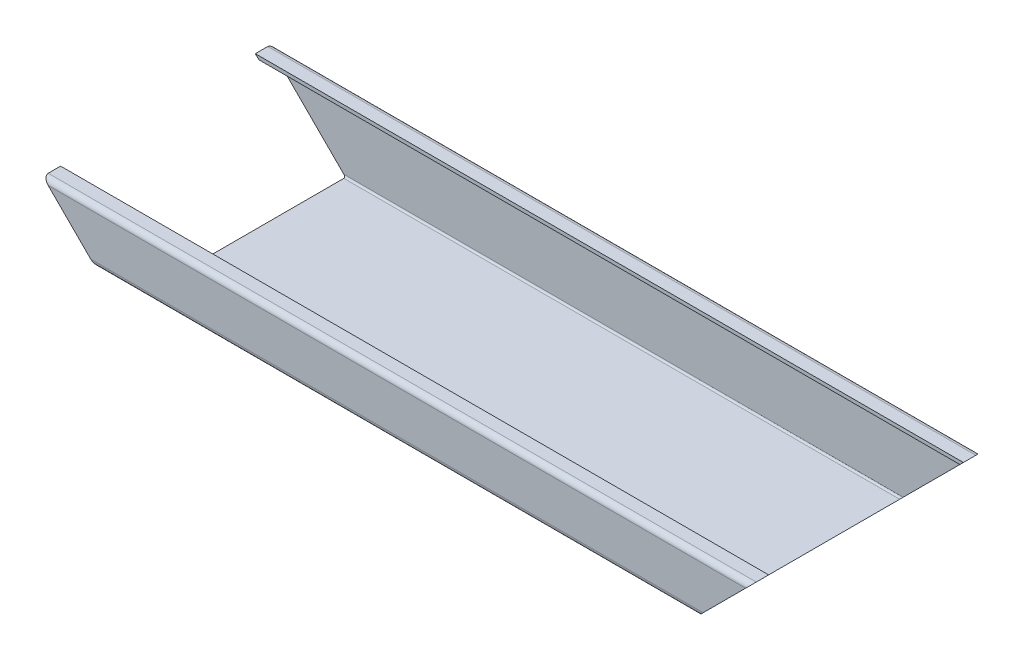
ISO-10303-21;
HEADER;
FILE_DESCRIPTION(('STEP AP214'),'2;1');
FILE_NAME('part.step','',(''),(''),'','','');
FILE_SCHEMA(('AUTOMOTIVE_DESIGN { 1 0 10303 214 1 1 1 1 }'));
ENDSEC;
DATA;
#1=APPLICATION_CONTEXT('core data for automotive mechanical design processes');
#2=APPLICATION_PROTOCOL_DEFINITION('international standard','automotive_design',2000,#1);
#3=PRODUCT_CONTEXT('',#1,'mechanical');
#4=PRODUCT('Part','Part','',(#3));
#5=PRODUCT_RELATED_PRODUCT_CATEGORY('part','',(#4));
#6=PRODUCT_DEFINITION_FORMATION('','',#4);
#7=PRODUCT_DEFINITION_CONTEXT('part definition',#1,'design');
#8=PRODUCT_DEFINITION('design','',#6,#7);
#9=PRODUCT_DEFINITION_SHAPE('','',#8);
#10=(LENGTH_UNIT() NAMED_UNIT(*) SI_UNIT(.MILLI.,.METRE.));
#11=(NAMED_UNIT(*) PLANE_ANGLE_UNIT() SI_UNIT($,.RADIAN.));
#12=(NAMED_UNIT(*) SI_UNIT($,.STERADIAN.) SOLID_ANGLE_UNIT());
#13=UNCERTAINTY_MEASURE_WITH_UNIT(LENGTH_MEASURE(1.E-05),#10,'distance_accuracy_value','');
#14=(GEOMETRIC_REPRESENTATION_CONTEXT(3) GLOBAL_UNCERTAINTY_ASSIGNED_CONTEXT((#13)) GLOBAL_UNIT_ASSIGNED_CONTEXT((#10,
#11,#12)) REPRESENTATION_CONTEXT('',''));
#15=CARTESIAN_POINT('',(0.,0.,0.));
#16=DIRECTION('',(0.,0.,1.));
#17=DIRECTION('',(1.,0.,0.));
#18=AXIS2_PLACEMENT_3D('',#15,#16,#17);
#19=CARTESIAN_POINT('',(200.,22.5,-62.));
#20=DIRECTION('',(0.,-1.,0.));
#21=DIRECTION('',(0.,0.,-1.));
#22=AXIS2_PLACEMENT_3D('',#19,#20,#21);
#23=PLANE('',#22);
#24=DIRECTION('',(0.,0.,1.));
#25=VECTOR('',#24,1.);
#26=CARTESIAN_POINT('',(-200.,22.5,-62.));
#27=LINE('',#26,#25);
#28=CARTESIAN_POINT('',(-200.,22.5,-62.));
#29=VERTEX_POINT('',#28);
#30=CARTESIAN_POINT('',(-200.,22.5,-55.));
#31=VERTEX_POINT('',#30);
#32=EDGE_CURVE('E312',#29,#31,#27,.T.);
#33=ORIENTED_EDGE('',*,*,#32,.T.);
#34=DIRECTION('',(-1.,0.,0.));
#35=VECTOR('',#34,1.);
#36=CARTESIAN_POINT('',(200.,22.5,-55.));
#37=LINE('',#36,#35);
#38=CARTESIAN_POINT('',(200.,22.5,-55.));
#39=VERTEX_POINT('',#38);
#40=EDGE_CURVE('E11',#39,#31,#37,.T.);
#41=ORIENTED_EDGE('',*,*,#40,.F.);
#42=DIRECTION('',(0.,0.,1.));
#43=VECTOR('',#42,1.);
#44=CARTESIAN_POINT('',(200.,22.5,-62.));
#45=LINE('',#44,#43);
#46=CARTESIAN_POINT('',(200.,22.5,-62.));
#47=VERTEX_POINT('',#46);
#48=EDGE_CURVE('E318',#47,#39,#45,.T.);
#49=ORIENTED_EDGE('',*,*,#48,.F.);
#50=DIRECTION('',(-1.,0.,0.));
#51=VECTOR('',#50,1.);
#52=CARTESIAN_POINT('',(200.,22.5,-62.));
#53=LINE('',#52,#51);
#54=EDGE_CURVE('E241',#47,#29,#53,.T.);
#55=ORIENTED_EDGE('',*,*,#54,.T.);
#56=EDGE_LOOP('',(#33,#41,#49,#55));
#57=FACE_BOUND('',#56,.T.);
#58=ADVANCED_FACE('F34',(#57),#23,.F.);
#59=CARTESIAN_POINT('',(200.,20.5,-55.));
#60=DIRECTION('',(0.,0.,1.));
#61=DIRECTION('',(1.,0.,0.));
#62=AXIS2_PLACEMENT_3D('',#59,#60,#61);
#63=PLANE('',#62);
#64=DIRECTION('',(-0.707106781186547,-0.707106781186548,0.));
#65=VECTOR('',#64,1.);
#66=CARTESIAN_POINT('',(199.,21.5,-55.));
#67=LINE('',#66,#65);
#68=CARTESIAN_POINT('',(198.,20.5,-55.));
#69=VERTEX_POINT('',#68);
#70=EDGE_CURVE('E403',#39,#69,#67,.T.);
#71=ORIENTED_EDGE('',*,*,#70,.F.);
#72=ORIENTED_EDGE('',*,*,#40,.T.);
#73=DIRECTION('',(-0.707106781186547,0.707106781186548,0.));
#74=VECTOR('',#73,1.);
#75=CARTESIAN_POINT('',(0.999999999999918,-178.5,-55.));
#76=LINE('',#75,#74);
#77=CARTESIAN_POINT('',(-198.,20.5,-55.));
#78=VERTEX_POINT('',#77);
#79=EDGE_CURVE('E304',#78,#31,#76,.T.);
#80=ORIENTED_EDGE('',*,*,#79,.F.);
#81=DIRECTION('',(-1.,0.,0.));
#82=VECTOR('',#81,1.);
#83=CARTESIAN_POINT('',(200.,20.5,-55.));
#84=LINE('',#83,#82);
#85=EDGE_CURVE('E42',#69,#78,#84,.T.);
#86=ORIENTED_EDGE('',*,*,#85,.F.);
#87=EDGE_LOOP('',(#71,#72,#80,#86));
#88=FACE_BOUND('',#87,.T.);
#89=ADVANCED_FACE('F309',(#88),#63,.T.);
#90=CARTESIAN_POINT('',(200.,20.5,-62.));
#91=DIRECTION('',(0.,-1.,0.));
#92=DIRECTION('',(0.,0.,-1.));
#93=AXIS2_PLACEMENT_3D('',#90,#91,#92);
#94=PLANE('',#93);
#95=DIRECTION('',(0.,0.,-1.));
#96=VECTOR('',#95,1.);
#97=CARTESIAN_POINT('',(198.,20.5,-62.));
#98=LINE('',#97,#96);
#99=CARTESIAN_POINT('',(198.,20.5,-62.));
#100=VERTEX_POINT('',#99);
#101=EDGE_CURVE('E297',#69,#100,#98,.T.);
#102=ORIENTED_EDGE('',*,*,#101,.F.);
#103=ORIENTED_EDGE('',*,*,#85,.T.);
#104=DIRECTION('',(0.,0.,1.));
#105=VECTOR('',#104,1.);
#106=CARTESIAN_POINT('',(-198.,20.5,-62.));
#107=LINE('',#106,#105);
#108=CARTESIAN_POINT('',(-198.,20.5,-62.));
#109=VERTEX_POINT('',#108);
#110=EDGE_CURVE('E296',#109,#78,#107,.T.);
#111=ORIENTED_EDGE('',*,*,#110,.F.);
#112=DIRECTION('',(-1.,0.,0.));
#113=VECTOR('',#112,1.);
#114=CARTESIAN_POINT('',(200.,20.5,-62.));
#115=LINE('',#114,#113);
#116=EDGE_CURVE('E288',#100,#109,#115,.T.);
#117=ORIENTED_EDGE('',*,*,#116,.F.);
#118=EDGE_LOOP('',(#102,#103,#111,#117));
#119=FACE_BOUND('',#118,.T.);
#120=ADVANCED_FACE('F294',(#119),#94,.T.);
#121=CARTESIAN_POINT('',(200.,19.5,-62.));
#122=DIRECTION('',(-1.,0.,0.));
#123=DIRECTION('',(0.,0.,1.));
#124=AXIS2_PLACEMENT_3D('',#121,#122,#123);
#125=CYLINDRICAL_SURFACE('',#124,1.);
#126=CARTESIAN_POINT('',(197.,19.5,-62.));
#127=DIRECTION('',(-0.707106781186548,0.707106781186548,0.));
#128=DIRECTION('',(-0.707106781186547,-0.707106781186548,0.));
#129=AXIS2_PLACEMENT_3D('',#126,#127,#128);
#130=ELLIPSE('',#129,1.4142135623731,1.);
#131=CARTESIAN_POINT('',(197.,19.5,-63.));
#132=VERTEX_POINT('',#131);
#133=EDGE_CURVE('E399',#100,#132,#130,.T.);
#134=ORIENTED_EDGE('',*,*,#133,.F.);
#135=ORIENTED_EDGE('',*,*,#116,.T.);
#136=CARTESIAN_POINT('',(-197.,19.5,-62.));
#137=DIRECTION('',(0.707106781186548,0.707106781186547,0.));
#138=DIRECTION('',(-0.707106781186547,0.707106781186548,0.));
#139=AXIS2_PLACEMENT_3D('',#136,#137,#138);
#140=ELLIPSE('',#139,1.4142135623731,1.);
#141=CARTESIAN_POINT('',(-197.,19.5,-63.));
#142=VERTEX_POINT('',#141);
#143=EDGE_CURVE('E307',#142,#109,#140,.T.);
#144=ORIENTED_EDGE('',*,*,#143,.F.);
#145=DIRECTION('',(-1.,0.,0.));
#146=VECTOR('',#145,1.);
#147=CARTESIAN_POINT('',(200.,19.5,-63.));
#148=LINE('',#147,#146);
#149=EDGE_CURVE('E286',#132,#142,#148,.T.);
#150=ORIENTED_EDGE('',*,*,#149,.F.);
#151=EDGE_LOOP('',(#134,#135,#144,#150));
#152=FACE_BOUND('',#151,.T.);
#153=ADVANCED_FACE('F398',(#152),#125,.F.);
#154=CARTESIAN_POINT('',(200.,-19.5,-63.));
#155=DIRECTION('',(0.,0.,1.));
#156=DIRECTION('',(1.,0.,0.));
#157=AXIS2_PLACEMENT_3D('',#154,#155,#156);
#158=PLANE('',#157);
#159=DIRECTION('',(-0.707106781186547,-0.707106781186548,0.));
#160=VECTOR('',#159,1.);
#161=CARTESIAN_POINT('',(179.,1.49999999999999,-63.));
#162=LINE('',#161,#160);
#163=CARTESIAN_POINT('',(158.,-19.5,-63.));
#164=VERTEX_POINT('',#163);
#165=EDGE_CURVE('E401',#132,#164,#162,.T.);
#166=ORIENTED_EDGE('',*,*,#165,.F.);
#167=ORIENTED_EDGE('',*,*,#149,.T.);
#168=DIRECTION('',(-0.707106781186547,0.707106781186548,0.));
#169=VECTOR('',#168,1.);
#170=CARTESIAN_POINT('',(20.9999999999999,-198.5,-63.));
#171=LINE('',#170,#169);
#172=CARTESIAN_POINT('',(-158.,-19.5,-63.));
#173=VERTEX_POINT('',#172);
#174=EDGE_CURVE('E390',#173,#142,#171,.T.);
#175=ORIENTED_EDGE('',*,*,#174,.F.);
#176=DIRECTION('',(-1.,0.,0.));
#177=VECTOR('',#176,1.);
#178=CARTESIAN_POINT('',(200.,-19.5,-63.));
#179=LINE('',#178,#177);
#180=EDGE_CURVE('E284',#164,#173,#179,.T.);
#181=ORIENTED_EDGE('',*,*,#180,.F.);
#182=EDGE_LOOP('',(#166,#167,#175,#181));
#183=FACE_BOUND('',#182,.T.);
#184=ADVANCED_FACE('F520',(#183),#158,.T.);
#185=CARTESIAN_POINT('',(200.,-19.5,-62.));
#186=DIRECTION('',(-1.,0.,0.));
#187=DIRECTION('',(0.,0.,1.));
#188=AXIS2_PLACEMENT_3D('',#185,#186,#187);
#189=CYLINDRICAL_SURFACE('',#188,1.);
#190=CARTESIAN_POINT('',(158.,-19.5,-62.));
#191=DIRECTION('',(-0.707106781186548,0.707106781186548,0.));
#192=DIRECTION('',(-0.707106781186547,-0.707106781186548,0.));
#193=AXIS2_PLACEMENT_3D('',#190,#191,#192);
#194=ELLIPSE('',#193,1.4142135623731,1.);
#195=CARTESIAN_POINT('',(157.,-20.5,-62.));
#196=VERTEX_POINT('',#195);
#197=EDGE_CURVE('E405',#164,#196,#194,.T.);
#198=ORIENTED_EDGE('',*,*,#197,.F.);
#199=ORIENTED_EDGE('',*,*,#180,.T.);
#200=CARTESIAN_POINT('',(-158.,-19.5,-62.));
#201=DIRECTION('',(0.707106781186548,0.707106781186547,0.));
#202=DIRECTION('',(-0.707106781186547,0.707106781186548,0.));
#203=AXIS2_PLACEMENT_3D('',#200,#201,#202);
#204=ELLIPSE('',#203,1.4142135623731,1.);
#205=CARTESIAN_POINT('',(-157.,-20.5,-62.));
#206=VERTEX_POINT('',#205);
#207=EDGE_CURVE('E387',#206,#173,#204,.T.);
#208=ORIENTED_EDGE('',*,*,#207,.F.);
#209=DIRECTION('',(-1.,0.,0.));
#210=VECTOR('',#209,1.);
#211=CARTESIAN_POINT('',(200.,-20.5,-62.));
#212=LINE('',#211,#210);
#213=EDGE_CURVE('E282',#196,#206,#212,.T.);
#214=ORIENTED_EDGE('',*,*,#213,.F.);
#215=EDGE_LOOP('',(#198,#199,#208,#214));
#216=FACE_BOUND('',#215,.T.);
#217=ADVANCED_FACE('F519',(#216),#189,.F.);
#218=CARTESIAN_POINT('',(200.,-20.5,27.));
#219=DIRECTION('',(0.,1.,0.));
#220=DIRECTION('',(0.,0.,1.));
#221=AXIS2_PLACEMENT_3D('',#218,#219,#220);
#222=PLANE('',#221);
#223=DIRECTION('',(0.,0.,1.));
#224=VECTOR('',#223,1.);
#225=CARTESIAN_POINT('',(157.,-20.5,27.));
#226=LINE('',#225,#224);
#227=CARTESIAN_POINT('',(157.,-20.5,27.));
#228=VERTEX_POINT('',#227);
#229=EDGE_CURVE('E515',#196,#228,#226,.T.);
#230=ORIENTED_EDGE('',*,*,#229,.F.);
#231=ORIENTED_EDGE('',*,*,#213,.T.);
#232=DIRECTION('',(0.,0.,-1.));
#233=VECTOR('',#232,1.);
#234=CARTESIAN_POINT('',(-157.,-20.5,27.));
#235=LINE('',#234,#233);
#236=CARTESIAN_POINT('',(-157.,-20.5,27.));
#237=VERTEX_POINT('',#236);
#238=EDGE_CURVE('E384',#237,#206,#235,.T.);
#239=ORIENTED_EDGE('',*,*,#238,.F.);
#240=DIRECTION('',(-1.,0.,0.));
#241=VECTOR('',#240,1.);
#242=CARTESIAN_POINT('',(200.,-20.5,27.));
#243=LINE('',#242,#241);
#244=EDGE_CURVE('E280',#228,#237,#243,.T.);
#245=ORIENTED_EDGE('',*,*,#244,.F.);
#246=EDGE_LOOP('',(#230,#231,#239,#245));
#247=FACE_BOUND('',#246,.T.);
#248=ADVANCED_FACE('F514',(#247),#222,.T.);
#249=CARTESIAN_POINT('',(200.,-19.5,27.));
#250=DIRECTION('',(-1.,0.,0.));
#251=DIRECTION('',(0.,0.,1.));
#252=AXIS2_PLACEMENT_3D('',#249,#250,#251);
#253=CYLINDRICAL_SURFACE('',#252,0.999999999999997);
#254=CARTESIAN_POINT('',(158.,-19.5,27.));
#255=DIRECTION('',(-0.707106781186548,0.707106781186548,0.));
#256=DIRECTION('',(-0.707106781186547,-0.707106781186548,0.));
#257=AXIS2_PLACEMENT_3D('',#254,#255,#256);
#258=ELLIPSE('',#257,1.41421356237309,0.999999999999997);
#259=CARTESIAN_POINT('',(158.,-19.5,28.));
#260=VERTEX_POINT('',#259);
#261=EDGE_CURVE('E511',#228,#260,#258,.T.);
#262=ORIENTED_EDGE('',*,*,#261,.F.);
#263=ORIENTED_EDGE('',*,*,#244,.T.);
#264=CARTESIAN_POINT('',(-158.,-19.5,27.));
#265=DIRECTION('',(0.707106781186548,0.707106781186547,0.));
#266=DIRECTION('',(-0.707106781186547,0.707106781186548,0.));
#267=AXIS2_PLACEMENT_3D('',#264,#265,#266);
#268=ELLIPSE('',#267,1.41421356237309,0.999999999999997);
#269=CARTESIAN_POINT('',(-158.,-19.5,28.));
#270=VERTEX_POINT('',#269);
#271=EDGE_CURVE('E381',#270,#237,#268,.T.);
#272=ORIENTED_EDGE('',*,*,#271,.F.);
#273=DIRECTION('',(-1.,0.,0.));
#274=VECTOR('',#273,1.);
#275=CARTESIAN_POINT('',(200.,-19.5,28.));
#276=LINE('',#275,#274);
#277=EDGE_CURVE('E278',#260,#270,#276,.T.);
#278=ORIENTED_EDGE('',*,*,#277,.F.);
#279=EDGE_LOOP('',(#262,#263,#272,#278));
#280=FACE_BOUND('',#279,.T.);
#281=ADVANCED_FACE('F509',(#280),#253,.F.);
#282=CARTESIAN_POINT('',(200.,-8.50000000000001,28.));
#283=DIRECTION('',(0.,0.,-1.));
#284=DIRECTION('',(-1.,0.,0.));
#285=AXIS2_PLACEMENT_3D('',#282,#283,#284);
#286=PLANE('',#285);
#287=DIRECTION('',(0.707106781186547,0.707106781186548,0.));
#288=VECTOR('',#287,1.);
#289=CARTESIAN_POINT('',(184.5,6.99999999999999,28.));
#290=LINE('',#289,#288);
#291=CARTESIAN_POINT('',(169.,-8.50000000000001,28.));
#292=VERTEX_POINT('',#291);
#293=EDGE_CURVE('E503',#260,#292,#290,.T.);
#294=ORIENTED_EDGE('',*,*,#293,.F.);
#295=ORIENTED_EDGE('',*,*,#277,.T.);
#296=DIRECTION('',(0.707106781186547,-0.707106781186548,0.));
#297=VECTOR('',#296,1.);
#298=CARTESIAN_POINT('',(15.4999999999999,-193.,28.));
#299=LINE('',#298,#297);
#300=CARTESIAN_POINT('',(-169.,-8.50000000000001,28.));
#301=VERTEX_POINT('',#300);
#302=EDGE_CURVE('E378',#301,#270,#299,.T.);
#303=ORIENTED_EDGE('',*,*,#302,.F.);
#304=DIRECTION('',(-1.,0.,0.));
#305=VECTOR('',#304,1.);
#306=CARTESIAN_POINT('',(200.,-8.50000000000001,28.));
#307=LINE('',#306,#305);
#308=EDGE_CURVE('E276',#292,#301,#307,.T.);
#309=ORIENTED_EDGE('',*,*,#308,.F.);
#310=EDGE_LOOP('',(#294,#295,#303,#309));
#311=FACE_BOUND('',#310,.T.);
#312=ADVANCED_FACE('F502',(#311),#286,.T.);
#313=CARTESIAN_POINT('',(200.,-8.50000000000001,31.));
#314=DIRECTION('',(-1.,0.,0.));
#315=DIRECTION('',(0.,0.,1.));
#316=AXIS2_PLACEMENT_3D('',#313,#314,#315);
#317=CYLINDRICAL_SURFACE('',#316,3.);
#318=CARTESIAN_POINT('',(169.,-8.50000000000001,31.));
#319=DIRECTION('',(-0.707106781186548,0.707106781186548,0.));
#320=DIRECTION('',(-0.707106781186547,-0.707106781186548,0.));
#321=AXIS2_PLACEMENT_3D('',#318,#319,#320);
#322=ELLIPSE('',#321,4.24264068711928,3.);
#323=CARTESIAN_POINT('',(172.,-5.50000000000001,31.));
#324=VERTEX_POINT('',#323);
#325=EDGE_CURVE('E499',#292,#324,#322,.F.);
#326=ORIENTED_EDGE('',*,*,#325,.F.);
#327=ORIENTED_EDGE('',*,*,#308,.T.);
#328=CARTESIAN_POINT('',(-169.,-8.50000000000001,31.));
#329=DIRECTION('',(0.707106781186548,0.707106781186547,0.));
#330=DIRECTION('',(-0.707106781186547,0.707106781186548,0.));
#331=AXIS2_PLACEMENT_3D('',#328,#329,#330);
#332=ELLIPSE('',#331,4.24264068711928,3.);
#333=CARTESIAN_POINT('',(-172.,-5.50000000000001,31.));
#334=VERTEX_POINT('',#333);
#335=EDGE_CURVE('E375',#334,#301,#332,.F.);
#336=ORIENTED_EDGE('',*,*,#335,.F.);
#337=DIRECTION('',(-1.,0.,0.));
#338=VECTOR('',#337,1.);
#339=CARTESIAN_POINT('',(200.,-5.50000000000001,31.));
#340=LINE('',#339,#338);
#341=EDGE_CURVE('E274',#324,#334,#340,.T.);
#342=ORIENTED_EDGE('',*,*,#341,.F.);
#343=EDGE_LOOP('',(#326,#327,#336,#342));
#344=FACE_BOUND('',#343,.T.);
#345=ADVANCED_FACE('F497',(#344),#317,.T.);
#346=CARTESIAN_POINT('',(200.,-5.50000000000001,62.));
#347=DIRECTION('',(0.,1.,0.));
#348=DIRECTION('',(0.,0.,1.));
#349=AXIS2_PLACEMENT_3D('',#346,#347,#348);
#350=PLANE('',#349);
#351=DIRECTION('',(0.,0.,1.));
#352=VECTOR('',#351,1.);
#353=CARTESIAN_POINT('',(172.,-5.50000000000001,62.));
#354=LINE('',#353,#352);
#355=CARTESIAN_POINT('',(172.,-5.50000000000001,62.));
#356=VERTEX_POINT('',#355);
#357=EDGE_CURVE('E491',#324,#356,#354,.T.);
#358=ORIENTED_EDGE('',*,*,#357,.F.);
#359=ORIENTED_EDGE('',*,*,#341,.T.);
#360=DIRECTION('',(0.,0.,-1.));
#361=VECTOR('',#360,1.);
#362=CARTESIAN_POINT('',(-172.,-5.50000000000001,62.));
#363=LINE('',#362,#361);
#364=CARTESIAN_POINT('',(-172.,-5.50000000000001,62.));
#365=VERTEX_POINT('',#364);
#366=EDGE_CURVE('E372',#365,#334,#363,.T.);
#367=ORIENTED_EDGE('',*,*,#366,.F.);
#368=DIRECTION('',(-1.,0.,0.));
#369=VECTOR('',#368,1.);
#370=CARTESIAN_POINT('',(200.,-5.50000000000001,62.));
#371=LINE('',#370,#369);
#372=EDGE_CURVE('E272',#356,#365,#371,.T.);
#373=ORIENTED_EDGE('',*,*,#372,.F.);
#374=EDGE_LOOP('',(#358,#359,#367,#373));
#375=FACE_BOUND('',#374,.T.);
#376=ADVANCED_FACE('F490',(#375),#350,.T.);
#377=CARTESIAN_POINT('',(200.,-4.50000000000001,62.));
#378=DIRECTION('',(-1.,0.,0.));
#379=DIRECTION('',(0.,0.,1.));
#380=AXIS2_PLACEMENT_3D('',#377,#378,#379);
#381=CYLINDRICAL_SURFACE('',#380,1.);
#382=CARTESIAN_POINT('',(173.,-4.50000000000001,62.));
#383=DIRECTION('',(-0.707106781186548,0.707106781186548,0.));
#384=DIRECTION('',(-0.707106781186547,-0.707106781186548,0.));
#385=AXIS2_PLACEMENT_3D('',#382,#383,#384);
#386=ELLIPSE('',#385,1.4142135623731,1.);
#387=CARTESIAN_POINT('',(173.,-4.50000000000001,63.));
#388=VERTEX_POINT('',#387);
#389=EDGE_CURVE('E487',#356,#388,#386,.T.);
#390=ORIENTED_EDGE('',*,*,#389,.F.);
#391=ORIENTED_EDGE('',*,*,#372,.T.);
#392=CARTESIAN_POINT('',(-173.,-4.50000000000001,62.));
#393=DIRECTION('',(0.707106781186548,0.707106781186547,0.));
#394=DIRECTION('',(-0.707106781186547,0.707106781186548,0.));
#395=AXIS2_PLACEMENT_3D('',#392,#393,#394);
#396=ELLIPSE('',#395,1.4142135623731,1.);
#397=CARTESIAN_POINT('',(-173.,-4.5,63.));
#398=VERTEX_POINT('',#397);
#399=EDGE_CURVE('E369',#398,#365,#396,.T.);
#400=ORIENTED_EDGE('',*,*,#399,.F.);
#401=DIRECTION('',(-1.,0.,0.));
#402=VECTOR('',#401,1.);
#403=CARTESIAN_POINT('',(200.,-4.50000000000001,63.));
#404=LINE('',#403,#402);
#405=EDGE_CURVE('E270',#388,#398,#404,.T.);
#406=ORIENTED_EDGE('',*,*,#405,.F.);
#407=EDGE_LOOP('',(#390,#391,#400,#406));
#408=FACE_BOUND('',#407,.T.);
#409=ADVANCED_FACE('F485',(#408),#381,.F.);
#410=CARTESIAN_POINT('',(200.,19.5,63.));
#411=DIRECTION('',(0.,0.,-1.));
#412=DIRECTION('',(0.,1.,0.));
#413=AXIS2_PLACEMENT_3D('',#410,#411,#412);
#414=PLANE('',#413);
#415=DIRECTION('',(0.707106781186547,0.707106781186548,0.));
#416=VECTOR('',#415,1.);
#417=CARTESIAN_POINT('',(198.5,21.,63.));
#418=LINE('',#417,#416);
#419=CARTESIAN_POINT('',(197.,19.5,63.));
#420=VERTEX_POINT('',#419);
#421=EDGE_CURVE('E479',#388,#420,#418,.T.);
#422=ORIENTED_EDGE('',*,*,#421,.F.);
#423=ORIENTED_EDGE('',*,*,#405,.T.);
#424=DIRECTION('',(0.707106781186547,-0.707106781186548,0.));
#425=VECTOR('',#424,1.);
#426=CARTESIAN_POINT('',(1.49999999999992,-179.,63.0000000000001));
#427=LINE('',#426,#425);
#428=CARTESIAN_POINT('',(-197.,19.5,63.));
#429=VERTEX_POINT('',#428);
#430=EDGE_CURVE('E366',#429,#398,#427,.T.);
#431=ORIENTED_EDGE('',*,*,#430,.F.);
#432=DIRECTION('',(-1.,0.,0.));
#433=VECTOR('',#432,1.);
#434=CARTESIAN_POINT('',(200.,19.5,63.));
#435=LINE('',#434,#433);
#436=EDGE_CURVE('E268',#420,#429,#435,.T.);
#437=ORIENTED_EDGE('',*,*,#436,.F.);
#438=EDGE_LOOP('',(#422,#423,#431,#437));
#439=FACE_BOUND('',#438,.T.);
#440=ADVANCED_FACE('F478',(#439),#414,.T.);
#441=CARTESIAN_POINT('',(200.,19.5,62.));
#442=DIRECTION('',(-1.,0.,0.));
#443=DIRECTION('',(0.,0.,1.));
#444=AXIS2_PLACEMENT_3D('',#441,#442,#443);
#445=CYLINDRICAL_SURFACE('',#444,1.);
#446=CARTESIAN_POINT('',(197.,19.5,62.));
#447=DIRECTION('',(-0.707106781186548,0.707106781186548,0.));
#448=DIRECTION('',(-0.707106781186547,-0.707106781186548,0.));
#449=AXIS2_PLACEMENT_3D('',#446,#447,#448);
#450=ELLIPSE('',#449,1.4142135623731,1.);
#451=CARTESIAN_POINT('',(198.,20.5,62.));
#452=VERTEX_POINT('',#451);
#453=EDGE_CURVE('E475',#420,#452,#450,.T.);
#454=ORIENTED_EDGE('',*,*,#453,.F.);
#455=ORIENTED_EDGE('',*,*,#436,.T.);
#456=CARTESIAN_POINT('',(-197.,19.5,62.));
#457=DIRECTION('',(0.707106781186548,0.707106781186547,0.));
#458=DIRECTION('',(-0.707106781186547,0.707106781186548,0.));
#459=AXIS2_PLACEMENT_3D('',#456,#457,#458);
#460=ELLIPSE('',#459,1.4142135623731,1.);
#461=CARTESIAN_POINT('',(-198.,20.5,62.));
#462=VERTEX_POINT('',#461);
#463=EDGE_CURVE('E363',#462,#429,#460,.T.);
#464=ORIENTED_EDGE('',*,*,#463,.F.);
#465=DIRECTION('',(-1.,0.,0.));
#466=VECTOR('',#465,1.);
#467=CARTESIAN_POINT('',(200.,20.5,62.));
#468=LINE('',#467,#466);
#469=EDGE_CURVE('E266',#452,#462,#468,.T.);
#470=ORIENTED_EDGE('',*,*,#469,.F.);
#471=EDGE_LOOP('',(#454,#455,#464,#470));
#472=FACE_BOUND('',#471,.T.);
#473=ADVANCED_FACE('F473',(#472),#445,.F.);
#474=CARTESIAN_POINT('',(200.,20.5,55.));
#475=DIRECTION('',(0.,-1.,0.));
#476=DIRECTION('',(0.,0.,-1.));
#477=AXIS2_PLACEMENT_3D('',#474,#475,#476);
#478=PLANE('',#477);
#479=DIRECTION('',(0.,0.,-1.));
#480=VECTOR('',#479,1.);
#481=CARTESIAN_POINT('',(198.,20.5,55.));
#482=LINE('',#481,#480);
#483=CARTESIAN_POINT('',(198.,20.5,55.));
#484=VERTEX_POINT('',#483);
#485=EDGE_CURVE('E467',#452,#484,#482,.T.);
#486=ORIENTED_EDGE('',*,*,#485,.F.);
#487=ORIENTED_EDGE('',*,*,#469,.T.);
#488=DIRECTION('',(0.,0.,1.));
#489=VECTOR('',#488,1.);
#490=CARTESIAN_POINT('',(-198.,20.5,54.9999999999998));
#491=LINE('',#490,#489);
#492=CARTESIAN_POINT('',(-198.,20.5,55.));
#493=VERTEX_POINT('',#492);
#494=EDGE_CURVE('E360',#493,#462,#491,.T.);
#495=ORIENTED_EDGE('',*,*,#494,.F.);
#496=DIRECTION('',(-1.,0.,0.));
#497=VECTOR('',#496,1.);
#498=CARTESIAN_POINT('',(200.,20.5,55.));
#499=LINE('',#498,#497);
#500=EDGE_CURVE('E264',#484,#493,#499,.T.);
#501=ORIENTED_EDGE('',*,*,#500,.F.);
#502=EDGE_LOOP('',(#486,#487,#495,#501));
#503=FACE_BOUND('',#502,.T.);
#504=ADVANCED_FACE('F466',(#503),#478,.T.);
#505=CARTESIAN_POINT('',(200.,22.5,55.));
#506=DIRECTION('',(0.,0.,-1.));
#507=DIRECTION('',(-1.,0.,0.));
#508=AXIS2_PLACEMENT_3D('',#505,#506,#507);
#509=PLANE('',#508);
#510=DIRECTION('',(0.707106781186547,0.707106781186548,0.));
#511=VECTOR('',#510,1.);
#512=CARTESIAN_POINT('',(200.,22.5,55.));
#513=LINE('',#512,#511);
#514=CARTESIAN_POINT('',(200.,22.5,55.));
#515=VERTEX_POINT('',#514);
#516=EDGE_CURVE('E48',#484,#515,#513,.T.);
#517=ORIENTED_EDGE('',*,*,#516,.F.);
#518=ORIENTED_EDGE('',*,*,#500,.T.);
#519=DIRECTION('',(0.707106781186547,-0.707106781186548,0.));
#520=VECTOR('',#519,1.);
#521=CARTESIAN_POINT('',(0.,-177.5,55.));
#522=LINE('',#521,#520);
#523=CARTESIAN_POINT('',(-200.,22.5,55.));
#524=VERTEX_POINT('',#523);
#525=EDGE_CURVE('E357',#524,#493,#522,.T.);
#526=ORIENTED_EDGE('',*,*,#525,.F.);
#527=DIRECTION('',(-1.,0.,0.));
#528=VECTOR('',#527,1.);
#529=CARTESIAN_POINT('',(200.,22.5,55.));
#530=LINE('',#529,#528);
#531=EDGE_CURVE('E261',#515,#524,#530,.T.);
#532=ORIENTED_EDGE('',*,*,#531,.F.);
#533=EDGE_LOOP('',(#517,#518,#526,#532));
#534=FACE_BOUND('',#533,.T.);
#535=ADVANCED_FACE('F462',(#534),#509,.T.);
#536=CARTESIAN_POINT('',(200.,22.5,55.));
#537=DIRECTION('',(0.,-1.,0.));
#538=DIRECTION('',(0.,0.,-1.));
#539=AXIS2_PLACEMENT_3D('',#536,#537,#538);
#540=PLANE('',#539);
#541=DIRECTION('',(0.,0.,1.));
#542=VECTOR('',#541,1.);
#543=CARTESIAN_POINT('',(-200.,22.5,55.));
#544=LINE('',#543,#542);
#545=CARTESIAN_POINT('',(-200.,22.5,62.));
#546=VERTEX_POINT('',#545);
#547=EDGE_CURVE('E314',#524,#546,#544,.T.);
#548=ORIENTED_EDGE('',*,*,#547,.T.);
#549=DIRECTION('',(-1.,0.,0.));
#550=VECTOR('',#549,1.);
#551=CARTESIAN_POINT('',(200.,22.5,62.));
#552=LINE('',#551,#550);
#553=CARTESIAN_POINT('',(200.,22.5,62.));
#554=VERTEX_POINT('',#553);
#555=EDGE_CURVE('E258',#554,#546,#552,.T.);
#556=ORIENTED_EDGE('',*,*,#555,.F.);
#557=DIRECTION('',(0.,0.,1.));
#558=VECTOR('',#557,1.);
#559=CARTESIAN_POINT('',(200.,22.5,55.));
#560=LINE('',#559,#558);
#561=EDGE_CURVE('E320',#515,#554,#560,.T.);
#562=ORIENTED_EDGE('',*,*,#561,.F.);
#563=ORIENTED_EDGE('',*,*,#531,.T.);
#564=EDGE_LOOP('',(#548,#556,#562,#563));
#565=FACE_BOUND('',#564,.T.);
#566=ADVANCED_FACE('F458',(#565),#540,.F.);
#567=CARTESIAN_POINT('',(200.,19.5,62.));
#568=DIRECTION('',(-1.,0.,0.));
#569=DIRECTION('',(0.,0.,1.));
#570=AXIS2_PLACEMENT_3D('',#567,#568,#569);
#571=CYLINDRICAL_SURFACE('',#570,3.);
#572=DIRECTION('',(-1.,0.,0.));
#573=VECTOR('',#572,1.);
#574=CARTESIAN_POINT('',(200.,19.5,65.));
#575=LINE('',#574,#573);
#576=CARTESIAN_POINT('',(197.,19.5,65.));
#577=VERTEX_POINT('',#576);
#578=CARTESIAN_POINT('',(-197.,19.5,65.));
#579=VERTEX_POINT('',#578);
#580=EDGE_CURVE('E256',#577,#579,#575,.T.);
#581=ORIENTED_EDGE('',*,*,#580,.F.);
#582=CARTESIAN_POINT('',(197.,19.5,62.));
#583=DIRECTION('',(-0.707106781186548,0.707106781186548,0.));
#584=DIRECTION('',(-0.707106781186547,-0.707106781186548,0.));
#585=AXIS2_PLACEMENT_3D('',#582,#583,#584);
#586=ELLIPSE('',#585,4.24264068711929,3.);
#587=EDGE_CURVE('E455',#577,#554,#586,.T.);
#588=ORIENTED_EDGE('',*,*,#587,.T.);
#589=ORIENTED_EDGE('',*,*,#555,.T.);
#590=CARTESIAN_POINT('',(-197.,19.5,62.));
#591=DIRECTION('',(0.707106781186548,0.707106781186547,0.));
#592=DIRECTION('',(-0.707106781186547,0.707106781186548,0.));
#593=AXIS2_PLACEMENT_3D('',#590,#591,#592);
#594=ELLIPSE('',#593,4.24264068711929,3.);
#595=EDGE_CURVE('E354',#546,#579,#594,.T.);
#596=ORIENTED_EDGE('',*,*,#595,.T.);
#597=EDGE_LOOP('',(#581,#588,#589,#596));
#598=FACE_BOUND('',#597,.T.);
#599=ADVANCED_FACE('F452',(#598),#571,.T.);
#600=CARTESIAN_POINT('',(200.,19.5,65.));
#601=DIRECTION('',(0.,0.,-1.));
#602=DIRECTION('',(0.,1.,0.));
#603=AXIS2_PLACEMENT_3D('',#600,#601,#602);
#604=PLANE('',#603);
#605=DIRECTION('',(-1.,0.,0.));
#606=VECTOR('',#605,1.);
#607=CARTESIAN_POINT('',(200.,-4.50000000000001,65.));
#608=LINE('',#607,#606);
#609=CARTESIAN_POINT('',(173.,-4.50000000000001,65.));
#610=VERTEX_POINT('',#609);
#611=CARTESIAN_POINT('',(-173.,-4.5,65.));
#612=VERTEX_POINT('',#611);
#613=EDGE_CURVE('E254',#610,#612,#608,.T.);
#614=ORIENTED_EDGE('',*,*,#613,.F.);
#615=DIRECTION('',(-0.707106781186547,-0.707106781186548,0.));
#616=VECTOR('',#615,1.);
#617=CARTESIAN_POINT('',(155.,-22.5,65.));
#618=LINE('',#617,#616);
#619=EDGE_CURVE('E449',#577,#610,#618,.T.);
#620=ORIENTED_EDGE('',*,*,#619,.F.);
#621=ORIENTED_EDGE('',*,*,#580,.T.);
#622=DIRECTION('',(-0.707106781186547,0.707106781186548,0.));
#623=VECTOR('',#622,1.);
#624=CARTESIAN_POINT('',(-155.,-22.5,65.));
#625=LINE('',#624,#623);
#626=EDGE_CURVE('E410',#612,#579,#625,.T.);
#627=ORIENTED_EDGE('',*,*,#626,.F.);
#628=EDGE_LOOP('',(#614,#620,#621,#627));
#629=FACE_BOUND('',#628,.T.);
#630=ADVANCED_FACE('F448',(#629),#604,.F.);
#631=CARTESIAN_POINT('',(200.,-4.50000000000001,62.));
#632=DIRECTION('',(-1.,0.,0.));
#633=DIRECTION('',(0.,0.,1.));
#634=AXIS2_PLACEMENT_3D('',#631,#632,#633);
#635=CYLINDRICAL_SURFACE('',#634,3.);
#636=DIRECTION('',(-1.,0.,0.));
#637=VECTOR('',#636,1.);
#638=CARTESIAN_POINT('',(200.,-7.50000000000001,62.));
#639=LINE('',#638,#637);
#640=CARTESIAN_POINT('',(170.,-7.50000000000001,62.));
#641=VERTEX_POINT('',#640);
#642=CARTESIAN_POINT('',(-170.,-7.50000000000001,62.));
#643=VERTEX_POINT('',#642);
#644=EDGE_CURVE('E252',#641,#643,#639,.T.);
#645=ORIENTED_EDGE('',*,*,#644,.F.);
#646=CARTESIAN_POINT('',(173.,-4.50000000000001,62.));
#647=DIRECTION('',(-0.707106781186548,0.707106781186548,0.));
#648=DIRECTION('',(-0.707106781186547,-0.707106781186548,0.));
#649=AXIS2_PLACEMENT_3D('',#646,#647,#648);
#650=ELLIPSE('',#649,4.24264068711929,3.);
#651=EDGE_CURVE('E445',#641,#610,#650,.T.);
#652=ORIENTED_EDGE('',*,*,#651,.T.);
#653=ORIENTED_EDGE('',*,*,#613,.T.);
#654=CARTESIAN_POINT('',(-173.,-4.50000000000001,62.));
#655=DIRECTION('',(0.707106781186548,0.707106781186547,0.));
#656=DIRECTION('',(-0.707106781186547,0.707106781186548,0.));
#657=AXIS2_PLACEMENT_3D('',#654,#655,#656);
#658=ELLIPSE('',#657,4.24264068711929,3.);
#659=EDGE_CURVE('E351',#612,#643,#658,.T.);
#660=ORIENTED_EDGE('',*,*,#659,.T.);
#661=EDGE_LOOP('',(#645,#652,#653,#660));
#662=FACE_BOUND('',#661,.T.);
#663=ADVANCED_FACE('F442',(#662),#635,.T.);
#664=CARTESIAN_POINT('',(200.,-7.50000000000001,62.));
#665=DIRECTION('',(0.,1.,0.));
#666=DIRECTION('',(0.,0.,1.));
#667=AXIS2_PLACEMENT_3D('',#664,#665,#666);
#668=PLANE('',#667);
#669=DIRECTION('',(-1.,0.,0.));
#670=VECTOR('',#669,1.);
#671=CARTESIAN_POINT('',(200.,-7.50000000000001,31.));
#672=LINE('',#671,#670);
#673=CARTESIAN_POINT('',(170.,-7.50000000000001,31.));
#674=VERTEX_POINT('',#673);
#675=CARTESIAN_POINT('',(-170.,-7.50000000000001,31.));
#676=VERTEX_POINT('',#675);
#677=EDGE_CURVE('E250',#674,#676,#672,.T.);
#678=ORIENTED_EDGE('',*,*,#677,.F.);
#679=DIRECTION('',(0.,0.,1.));
#680=VECTOR('',#679,1.);
#681=CARTESIAN_POINT('',(170.,-7.50000000000001,62.));
#682=LINE('',#681,#680);
#683=EDGE_CURVE('E437',#674,#641,#682,.T.);
#684=ORIENTED_EDGE('',*,*,#683,.T.);
#685=ORIENTED_EDGE('',*,*,#644,.T.);
#686=DIRECTION('',(0.,0.,-1.));
#687=VECTOR('',#686,1.);
#688=CARTESIAN_POINT('',(-170.,-7.50000000000001,62.));
#689=LINE('',#688,#687);
#690=EDGE_CURVE('E348',#643,#676,#689,.T.);
#691=ORIENTED_EDGE('',*,*,#690,.T.);
#692=EDGE_LOOP('',(#678,#684,#685,#691));
#693=FACE_BOUND('',#692,.T.);
#694=ADVANCED_FACE('F436',(#693),#668,.F.);
#695=CARTESIAN_POINT('',(200.,-8.50000000000001,31.));
#696=DIRECTION('',(-1.,0.,0.));
#697=DIRECTION('',(0.,0.,1.));
#698=AXIS2_PLACEMENT_3D('',#695,#696,#697);
#699=CYLINDRICAL_SURFACE('',#698,1.);
#700=DIRECTION('',(-1.,0.,0.));
#701=VECTOR('',#700,1.);
#702=CARTESIAN_POINT('',(200.,-8.50000000000001,30.));
#703=LINE('',#702,#701);
#704=CARTESIAN_POINT('',(169.,-8.50000000000001,30.));
#705=VERTEX_POINT('',#704);
#706=CARTESIAN_POINT('',(-169.,-8.50000000000004,30.));
#707=VERTEX_POINT('',#706);
#708=EDGE_CURVE('E248',#705,#707,#703,.T.);
#709=ORIENTED_EDGE('',*,*,#708,.F.);
#710=CARTESIAN_POINT('',(169.,-8.50000000000001,31.));
#711=DIRECTION('',(-0.707106781186548,0.707106781186548,0.));
#712=DIRECTION('',(-0.707106781186547,-0.707106781186548,0.));
#713=AXIS2_PLACEMENT_3D('',#710,#711,#712);
#714=ELLIPSE('',#713,1.41421356237309,1.);
#715=EDGE_CURVE('E433',#705,#674,#714,.F.);
#716=ORIENTED_EDGE('',*,*,#715,.T.);
#717=ORIENTED_EDGE('',*,*,#677,.T.);
#718=CARTESIAN_POINT('',(-169.,-8.50000000000001,31.));
#719=DIRECTION('',(0.707106781186548,0.707106781186547,0.));
#720=DIRECTION('',(-0.707106781186547,0.707106781186548,0.));
#721=AXIS2_PLACEMENT_3D('',#718,#719,#720);
#722=ELLIPSE('',#721,1.41421356237309,1.);
#723=EDGE_CURVE('E345',#676,#707,#722,.F.);
#724=ORIENTED_EDGE('',*,*,#723,.T.);
#725=EDGE_LOOP('',(#709,#716,#717,#724));
#726=FACE_BOUND('',#725,.T.);
#727=ADVANCED_FACE('F430',(#726),#699,.F.);
#728=CARTESIAN_POINT('',(200.,-8.50000000000001,30.));
#729=DIRECTION('',(0.,0.,-1.));
#730=DIRECTION('',(-1.,0.,0.));
#731=AXIS2_PLACEMENT_3D('',#728,#729,#730);
#732=PLANE('',#731);
#733=DIRECTION('',(-1.,0.,0.));
#734=VECTOR('',#733,1.);
#735=CARTESIAN_POINT('',(200.,-19.5,30.));
#736=LINE('',#735,#734);
#737=CARTESIAN_POINT('',(158.,-19.5,30.));
#738=VERTEX_POINT('',#737);
#739=CARTESIAN_POINT('',(-158.,-19.5,30.));
#740=VERTEX_POINT('',#739);
#741=EDGE_CURVE('E246',#738,#740,#736,.T.);
#742=ORIENTED_EDGE('',*,*,#741,.F.);
#743=DIRECTION('',(0.707106781186547,0.707106781186548,0.));
#744=VECTOR('',#743,1.);
#745=CARTESIAN_POINT('',(184.5,6.99999999999999,30.));
#746=LINE('',#745,#744);
#747=EDGE_CURVE('E425',#738,#705,#746,.T.);
#748=ORIENTED_EDGE('',*,*,#747,.T.);
#749=ORIENTED_EDGE('',*,*,#708,.T.);
#750=DIRECTION('',(0.707106781186547,-0.707106781186548,0.));
#751=VECTOR('',#750,1.);
#752=CARTESIAN_POINT('',(15.4999999999999,-193.,30.));
#753=LINE('',#752,#751);
#754=EDGE_CURVE('E342',#707,#740,#753,.T.);
#755=ORIENTED_EDGE('',*,*,#754,.T.);
#756=EDGE_LOOP('',(#742,#748,#749,#755));
#757=FACE_BOUND('',#756,.T.);
#758=ADVANCED_FACE('F424',(#757),#732,.F.);
#759=CARTESIAN_POINT('',(200.,-19.5,27.));
#760=DIRECTION('',(-1.,0.,0.));
#761=DIRECTION('',(0.,0.,1.));
#762=AXIS2_PLACEMENT_3D('',#759,#760,#761);
#763=CYLINDRICAL_SURFACE('',#762,3.);
#764=DIRECTION('',(-1.,0.,0.));
#765=VECTOR('',#764,1.);
#766=CARTESIAN_POINT('',(200.,-22.5,27.));
#767=LINE('',#766,#765);
#768=CARTESIAN_POINT('',(155.,-22.5,27.));
#769=VERTEX_POINT('',#768);
#770=CARTESIAN_POINT('',(-155.,-22.5,27.));
#771=VERTEX_POINT('',#770);
#772=EDGE_CURVE('E239',#769,#771,#767,.T.);
#773=ORIENTED_EDGE('',*,*,#772,.F.);
#774=CARTESIAN_POINT('',(158.,-19.5,27.));
#775=DIRECTION('',(-0.707106781186548,0.707106781186548,0.));
#776=DIRECTION('',(-0.707106781186547,-0.707106781186548,0.));
#777=AXIS2_PLACEMENT_3D('',#774,#775,#776);
#778=ELLIPSE('',#777,4.24264068711928,3.);
#779=EDGE_CURVE('E222',#769,#738,#778,.T.);
#780=ORIENTED_EDGE('',*,*,#779,.T.);
#781=ORIENTED_EDGE('',*,*,#741,.T.);
#782=CARTESIAN_POINT('',(-158.,-19.5,27.));
#783=DIRECTION('',(0.707106781186548,0.707106781186547,0.));
#784=DIRECTION('',(-0.707106781186547,0.707106781186548,0.));
#785=AXIS2_PLACEMENT_3D('',#782,#783,#784);
#786=ELLIPSE('',#785,4.24264068711928,3.);
#787=EDGE_CURVE('E334',#740,#771,#786,.T.);
#788=ORIENTED_EDGE('',*,*,#787,.T.);
#789=EDGE_LOOP('',(#773,#780,#781,#788));
#790=FACE_BOUND('',#789,.T.);
#791=ADVANCED_FACE('F419',(#790),#763,.T.);
#792=CARTESIAN_POINT('',(200.,-22.5,27.));
#793=DIRECTION('',(0.,1.,0.));
#794=DIRECTION('',(0.,0.,1.));
#795=AXIS2_PLACEMENT_3D('',#792,#793,#794);
#796=PLANE('',#795);
#797=DIRECTION('',(-1.,0.,0.));
#798=VECTOR('',#797,1.);
#799=CARTESIAN_POINT('',(200.,-22.5,-62.));
#800=LINE('',#799,#798);
#801=CARTESIAN_POINT('',(155.,-22.5,-62.));
#802=VERTEX_POINT('',#801);
#803=CARTESIAN_POINT('',(-155.,-22.5,-62.));
#804=VERTEX_POINT('',#803);
#805=EDGE_CURVE('E237',#802,#804,#800,.T.);
#806=ORIENTED_EDGE('',*,*,#805,.F.);
#807=DIRECTION('',(0.,0.,1.));
#808=VECTOR('',#807,1.);
#809=CARTESIAN_POINT('',(155.,-22.5,-128.639610306789));
#810=LINE('',#809,#808);
#811=EDGE_CURVE('E218',#802,#769,#810,.T.);
#812=ORIENTED_EDGE('',*,*,#811,.T.);
#813=ORIENTED_EDGE('',*,*,#772,.T.);
#814=DIRECTION('',(0.,0.,1.));
#815=VECTOR('',#814,1.);
#816=CARTESIAN_POINT('',(-155.,-22.5,-128.639610306789));
#817=LINE('',#816,#815);
#818=EDGE_CURVE('E336',#804,#771,#817,.T.);
#819=ORIENTED_EDGE('',*,*,#818,.F.);
#820=EDGE_LOOP('',(#806,#812,#813,#819));
#821=FACE_BOUND('',#820,.T.);
#822=ADVANCED_FACE('F540',(#821),#796,.F.);
#823=CARTESIAN_POINT('',(200.,-19.5,-62.));
#824=DIRECTION('',(-1.,0.,0.));
#825=DIRECTION('',(0.,0.,1.));
#826=AXIS2_PLACEMENT_3D('',#823,#824,#825);
#827=CYLINDRICAL_SURFACE('',#826,3.);
#828=DIRECTION('',(-1.,0.,0.));
#829=VECTOR('',#828,1.);
#830=CARTESIAN_POINT('',(200.,-19.5,-65.));
#831=LINE('',#830,#829);
#832=CARTESIAN_POINT('',(158.,-19.5,-65.));
#833=VERTEX_POINT('',#832);
#834=CARTESIAN_POINT('',(-158.,-19.5,-65.));
#835=VERTEX_POINT('',#834);
#836=EDGE_CURVE('E229',#833,#835,#831,.T.);
#837=ORIENTED_EDGE('',*,*,#836,.F.);
#838=CARTESIAN_POINT('',(158.,-19.5,-62.));
#839=DIRECTION('',(-0.707106781186548,0.707106781186548,0.));
#840=DIRECTION('',(-0.707106781186547,-0.707106781186548,0.));
#841=AXIS2_PLACEMENT_3D('',#838,#839,#840);
#842=ELLIPSE('',#841,4.24264068711929,3.);
#843=EDGE_CURVE('E212',#833,#802,#842,.T.);
#844=ORIENTED_EDGE('',*,*,#843,.T.);
#845=ORIENTED_EDGE('',*,*,#805,.T.);
#846=CARTESIAN_POINT('',(-158.,-19.5,-62.));
#847=DIRECTION('',(0.707106781186548,0.707106781186547,0.));
#848=DIRECTION('',(-0.707106781186547,0.707106781186548,0.));
#849=AXIS2_PLACEMENT_3D('',#846,#847,#848);
#850=ELLIPSE('',#849,4.24264068711929,3.);
#851=EDGE_CURVE('E236',#804,#835,#850,.T.);
#852=ORIENTED_EDGE('',*,*,#851,.T.);
#853=EDGE_LOOP('',(#837,#844,#845,#852));
#854=FACE_BOUND('',#853,.T.);
#855=ADVANCED_FACE('F234',(#854),#827,.T.);
#856=CARTESIAN_POINT('',(200.,-19.5,-65.));
#857=DIRECTION('',(0.,0.,1.));
#858=DIRECTION('',(1.,0.,0.));
#859=AXIS2_PLACEMENT_3D('',#856,#857,#858);
#860=PLANE('',#859);
#861=DIRECTION('',(-1.,0.,0.));
#862=VECTOR('',#861,1.);
#863=CARTESIAN_POINT('',(200.,19.5,-65.));
#864=LINE('',#863,#862);
#865=CARTESIAN_POINT('',(197.,19.5,-65.));
#866=VERTEX_POINT('',#865);
#867=CARTESIAN_POINT('',(-197.,19.5,-65.));
#868=VERTEX_POINT('',#867);
#869=EDGE_CURVE('E231',#866,#868,#864,.T.);
#870=ORIENTED_EDGE('',*,*,#869,.F.);
#871=DIRECTION('',(0.707106781186547,0.707106781186548,0.));
#872=VECTOR('',#871,1.);
#873=CARTESIAN_POINT('',(155.,-22.5,-65.));
#874=LINE('',#873,#872);
#875=EDGE_CURVE('E215',#833,#866,#874,.T.);
#876=ORIENTED_EDGE('',*,*,#875,.F.);
#877=ORIENTED_EDGE('',*,*,#836,.T.);
#878=DIRECTION('',(0.707106781186547,-0.707106781186548,0.));
#879=VECTOR('',#878,1.);
#880=CARTESIAN_POINT('',(-155.,-22.5,-65.));
#881=LINE('',#880,#879);
#882=EDGE_CURVE('E332',#868,#835,#881,.T.);
#883=ORIENTED_EDGE('',*,*,#882,.F.);
#884=EDGE_LOOP('',(#870,#876,#877,#883));
#885=FACE_BOUND('',#884,.T.);
#886=ADVANCED_FACE('F227',(#885),#860,.F.);
#887=CARTESIAN_POINT('',(200.,19.5,-62.));
#888=DIRECTION('',(-1.,0.,0.));
#889=DIRECTION('',(0.,0.,1.));
#890=AXIS2_PLACEMENT_3D('',#887,#888,#889);
#891=CYLINDRICAL_SURFACE('',#890,3.);
#892=ORIENTED_EDGE('',*,*,#54,.F.);
#893=CARTESIAN_POINT('',(197.,19.5,-62.));
#894=DIRECTION('',(-0.707106781186548,0.707106781186548,0.));
#895=DIRECTION('',(-0.707106781186547,-0.707106781186548,0.));
#896=AXIS2_PLACEMENT_3D('',#893,#894,#895);
#897=ELLIPSE('',#896,4.24264068711929,3.);
#898=EDGE_CURVE('E223',#47,#866,#897,.T.);
#899=ORIENTED_EDGE('',*,*,#898,.T.);
#900=ORIENTED_EDGE('',*,*,#869,.T.);
#901=CARTESIAN_POINT('',(-197.,19.5,-62.));
#902=DIRECTION('',(0.707106781186548,0.707106781186547,0.));
#903=DIRECTION('',(-0.707106781186547,0.707106781186548,0.));
#904=AXIS2_PLACEMENT_3D('',#901,#902,#903);
#905=ELLIPSE('',#904,4.24264068711929,3.);
#906=EDGE_CURVE('E331',#868,#29,#905,.T.);
#907=ORIENTED_EDGE('',*,*,#906,.T.);
#908=EDGE_LOOP('',(#892,#899,#900,#907));
#909=FACE_BOUND('',#908,.T.);
#910=ADVANCED_FACE('F329',(#909),#891,.T.);
#911=CARTESIAN_POINT('',(-155.,-22.5,-128.639610306789));
#912=DIRECTION('',(0.707106781186548,0.707106781186547,0.));
#913=DIRECTION('',(-0.707106781186547,0.707106781186548,0.));
#914=AXIS2_PLACEMENT_3D('',#911,#912,#913);
#915=PLANE('',#914);
#916=ORIENTED_EDGE('',*,*,#79,.T.);
#917=ORIENTED_EDGE('',*,*,#32,.F.);
#918=ORIENTED_EDGE('',*,*,#906,.F.);
#919=ORIENTED_EDGE('',*,*,#882,.T.);
#920=ORIENTED_EDGE('',*,*,#851,.F.);
#921=ORIENTED_EDGE('',*,*,#818,.T.);
#922=ORIENTED_EDGE('',*,*,#787,.F.);
#923=ORIENTED_EDGE('',*,*,#754,.F.);
#924=ORIENTED_EDGE('',*,*,#723,.F.);
#925=ORIENTED_EDGE('',*,*,#690,.F.);
#926=ORIENTED_EDGE('',*,*,#659,.F.);
#927=ORIENTED_EDGE('',*,*,#626,.T.);
#928=ORIENTED_EDGE('',*,*,#595,.F.);
#929=ORIENTED_EDGE('',*,*,#547,.F.);
#930=ORIENTED_EDGE('',*,*,#525,.T.);
#931=ORIENTED_EDGE('',*,*,#494,.T.);
#932=ORIENTED_EDGE('',*,*,#463,.T.);
#933=ORIENTED_EDGE('',*,*,#430,.T.);
#934=ORIENTED_EDGE('',*,*,#399,.T.);
#935=ORIENTED_EDGE('',*,*,#366,.T.);
#936=ORIENTED_EDGE('',*,*,#335,.T.);
#937=ORIENTED_EDGE('',*,*,#302,.T.);
#938=ORIENTED_EDGE('',*,*,#271,.T.);
#939=ORIENTED_EDGE('',*,*,#238,.T.);
#940=ORIENTED_EDGE('',*,*,#207,.T.);
#941=ORIENTED_EDGE('',*,*,#174,.T.);
#942=ORIENTED_EDGE('',*,*,#143,.T.);
#943=ORIENTED_EDGE('',*,*,#110,.T.);
#944=EDGE_LOOP('',(#916,#917,#918,#919,#920,#921,#922,#923,#924,#925,#926,#927,#928,#929,#930,
#931,#932,#933,#934,#935,#936,#937,#938,#939,#940,#941,#942,#943));
#945=FACE_BOUND('',#944,.T.);
#946=ADVANCED_FACE('F303',(#945),#915,.F.);
#947=CARTESIAN_POINT('',(155.,-22.5,-128.639610306789));
#948=DIRECTION('',(-0.707106781186548,0.707106781186548,0.));
#949=DIRECTION('',(-0.707106781186547,-0.707106781186548,0.));
#950=AXIS2_PLACEMENT_3D('',#947,#948,#949);
#951=PLANE('',#950);
#952=ORIENTED_EDGE('',*,*,#70,.T.);
#953=ORIENTED_EDGE('',*,*,#101,.T.);
#954=ORIENTED_EDGE('',*,*,#133,.T.);
#955=ORIENTED_EDGE('',*,*,#165,.T.);
#956=ORIENTED_EDGE('',*,*,#197,.T.);
#957=ORIENTED_EDGE('',*,*,#229,.T.);
#958=ORIENTED_EDGE('',*,*,#261,.T.);
#959=ORIENTED_EDGE('',*,*,#293,.T.);
#960=ORIENTED_EDGE('',*,*,#325,.T.);
#961=ORIENTED_EDGE('',*,*,#357,.T.);
#962=ORIENTED_EDGE('',*,*,#389,.T.);
#963=ORIENTED_EDGE('',*,*,#421,.T.);
#964=ORIENTED_EDGE('',*,*,#453,.T.);
#965=ORIENTED_EDGE('',*,*,#485,.T.);
#966=ORIENTED_EDGE('',*,*,#516,.T.);
#967=ORIENTED_EDGE('',*,*,#561,.T.);
#968=ORIENTED_EDGE('',*,*,#587,.F.);
#969=ORIENTED_EDGE('',*,*,#619,.T.);
#970=ORIENTED_EDGE('',*,*,#651,.F.);
#971=ORIENTED_EDGE('',*,*,#683,.F.);
#972=ORIENTED_EDGE('',*,*,#715,.F.);
#973=ORIENTED_EDGE('',*,*,#747,.F.);
#974=ORIENTED_EDGE('',*,*,#779,.F.);
#975=ORIENTED_EDGE('',*,*,#811,.F.);
#976=ORIENTED_EDGE('',*,*,#843,.F.);
#977=ORIENTED_EDGE('',*,*,#875,.T.);
#978=ORIENTED_EDGE('',*,*,#898,.F.);
#979=ORIENTED_EDGE('',*,*,#48,.T.);
#980=EDGE_LOOP('',(#952,#953,#954,#955,#956,#957,#958,#959,#960,#961,#962,#963,#964,#965,#966,
#967,#968,#969,#970,#971,#972,#973,#974,#975,#976,#977,#978,#979));
#981=FACE_BOUND('',#980,.T.);
#982=ADVANCED_FACE('F214',(#981),#951,.F.);
#983=CLOSED_SHELL('',(#58,#89,#120,#153,#184,#217,#248,#281,#312,#345,#376,#409,#440,#473,#504,
#535,#566,#599,#630,#663,#694,#727,#758,#791,#822,#855,#886,#910,#946,#982));
#984=MANIFOLD_SOLID_BREP('B2',#983);
#985=ADVANCED_BREP_SHAPE_REPRESENTATION('',(#18,#984),#14);
#986=SHAPE_DEFINITION_REPRESENTATION(#9,#985);
ENDSEC;
END-ISO-10303-21;
